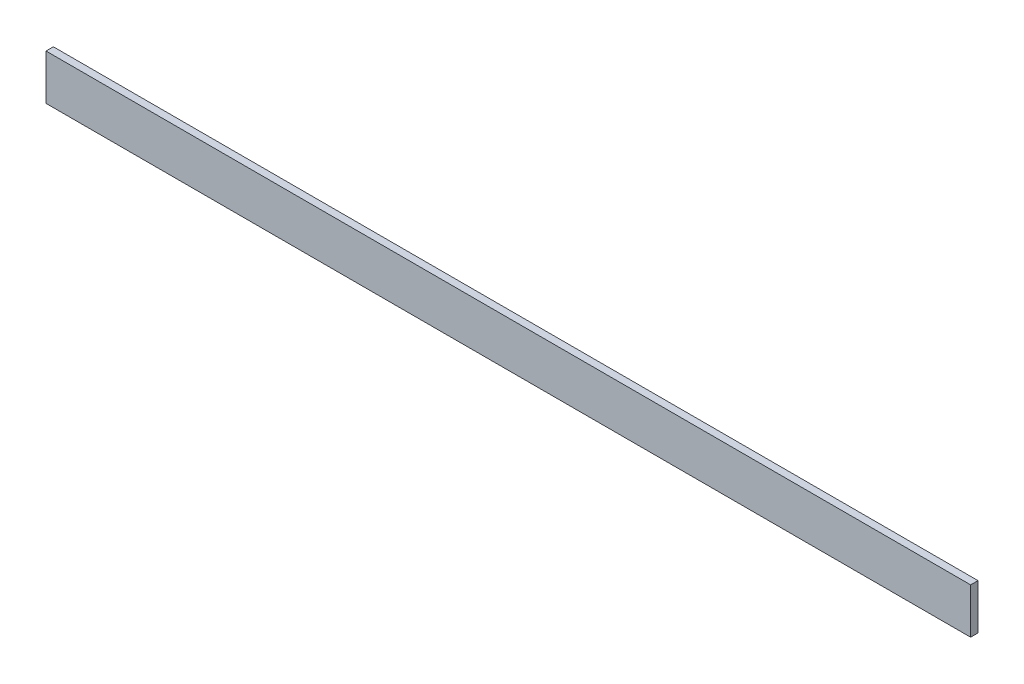
ISO-10303-21;
HEADER;
FILE_DESCRIPTION(('STEP AP214'),'2;1');
FILE_NAME('part.step','',(''),(''),'','','');
FILE_SCHEMA(('AUTOMOTIVE_DESIGN { 1 0 10303 214 1 1 1 1 }'));
ENDSEC;
DATA;
#1=APPLICATION_CONTEXT('core data for automotive mechanical design processes');
#2=APPLICATION_PROTOCOL_DEFINITION('international standard','automotive_design',2000,#1);
#3=PRODUCT_CONTEXT('',#1,'mechanical');
#4=PRODUCT('Part','Part','',(#3));
#5=PRODUCT_RELATED_PRODUCT_CATEGORY('part','',(#4));
#6=PRODUCT_DEFINITION_FORMATION('','',#4);
#7=PRODUCT_DEFINITION_CONTEXT('part definition',#1,'design');
#8=PRODUCT_DEFINITION('design','',#6,#7);
#9=PRODUCT_DEFINITION_SHAPE('','',#8);
#10=(LENGTH_UNIT() NAMED_UNIT(*) SI_UNIT(.MILLI.,.METRE.));
#11=(NAMED_UNIT(*) PLANE_ANGLE_UNIT() SI_UNIT($,.RADIAN.));
#12=(NAMED_UNIT(*) SI_UNIT($,.STERADIAN.) SOLID_ANGLE_UNIT());
#13=UNCERTAINTY_MEASURE_WITH_UNIT(LENGTH_MEASURE(1.E-05),#10,'distance_accuracy_value','');
#14=(GEOMETRIC_REPRESENTATION_CONTEXT(3) GLOBAL_UNCERTAINTY_ASSIGNED_CONTEXT((#13)) GLOBAL_UNIT_ASSIGNED_CONTEXT((#10,
#11,#12)) REPRESENTATION_CONTEXT('',''));
#15=CARTESIAN_POINT('',(0.,0.,0.));
#16=DIRECTION('',(0.,0.,1.));
#17=DIRECTION('',(1.,0.,0.));
#18=AXIS2_PLACEMENT_3D('',#15,#16,#17);
#19=CARTESIAN_POINT('',(0.,0.,38.1));
#20=DIRECTION('',(1.,0.,0.));
#21=DIRECTION('',(0.,0.,-1.));
#22=AXIS2_PLACEMENT_3D('',#19,#20,#21);
#23=PLANE('',#22);
#24=DIRECTION('',(0.,-1.,0.));
#25=VECTOR('',#24,1.);
#26=CARTESIAN_POINT('',(0.,0.,0.));
#27=LINE('',#26,#25);
#28=CARTESIAN_POINT('',(0.,234.95,0.));
#29=VERTEX_POINT('',#28);
#30=CARTESIAN_POINT('',(0.,0.,0.));
#31=VERTEX_POINT('',#30);
#32=EDGE_CURVE('E96',#29,#31,#27,.T.);
#33=ORIENTED_EDGE('',*,*,#32,.T.);
#34=DIRECTION('',(0.,0.,-1.));
#35=VECTOR('',#34,1.);
#36=CARTESIAN_POINT('',(0.,0.,38.1));
#37=LINE('',#36,#35);
#38=CARTESIAN_POINT('',(0.,0.,38.1));
#39=VERTEX_POINT('',#38);
#40=EDGE_CURVE('E11',#39,#31,#37,.T.);
#41=ORIENTED_EDGE('',*,*,#40,.F.);
#42=DIRECTION('',(0.,-1.,0.));
#43=VECTOR('',#42,1.);
#44=CARTESIAN_POINT('',(0.,0.,38.1));
#45=LINE('',#44,#43);
#46=CARTESIAN_POINT('',(0.,234.95,38.1));
#47=VERTEX_POINT('',#46);
#48=EDGE_CURVE('E84',#47,#39,#45,.T.);
#49=ORIENTED_EDGE('',*,*,#48,.F.);
#50=DIRECTION('',(0.,0.,-1.));
#51=VECTOR('',#50,1.);
#52=CARTESIAN_POINT('',(0.,234.95,38.1));
#53=LINE('',#52,#51);
#54=EDGE_CURVE('E92',#47,#29,#53,.T.);
#55=ORIENTED_EDGE('',*,*,#54,.T.);
#56=EDGE_LOOP('',(#33,#41,#49,#55));
#57=FACE_BOUND('',#56,.T.);
#58=ADVANCED_FACE('F33',(#57),#23,.F.);
#59=CARTESIAN_POINT('',(0.,0.,38.1));
#60=DIRECTION('',(0.,1.,0.));
#61=DIRECTION('',(0.,0.,1.));
#62=AXIS2_PLACEMENT_3D('',#59,#60,#61);
#63=PLANE('',#62);
#64=DIRECTION('',(1.,0.,0.));
#65=VECTOR('',#64,1.);
#66=CARTESIAN_POINT('',(0.,0.,0.));
#67=LINE('',#66,#65);
#68=CARTESIAN_POINT('',(4787.9,0.,0.));
#69=VERTEX_POINT('',#68);
#70=EDGE_CURVE('E88',#31,#69,#67,.T.);
#71=ORIENTED_EDGE('',*,*,#70,.T.);
#72=DIRECTION('',(0.,0.,-1.));
#73=VECTOR('',#72,1.);
#74=CARTESIAN_POINT('',(4787.9,0.,38.1));
#75=LINE('',#74,#73);
#76=CARTESIAN_POINT('',(4787.9,0.,38.1));
#77=VERTEX_POINT('',#76);
#78=EDGE_CURVE('E41',#77,#69,#75,.T.);
#79=ORIENTED_EDGE('',*,*,#78,.F.);
#80=DIRECTION('',(1.,0.,0.));
#81=VECTOR('',#80,1.);
#82=CARTESIAN_POINT('',(0.,0.,38.1));
#83=LINE('',#82,#81);
#84=EDGE_CURVE('E79',#39,#77,#83,.T.);
#85=ORIENTED_EDGE('',*,*,#84,.F.);
#86=ORIENTED_EDGE('',*,*,#40,.T.);
#87=EDGE_LOOP('',(#71,#79,#85,#86));
#88=FACE_BOUND('',#87,.T.);
#89=ADVANCED_FACE('F87',(#88),#63,.F.);
#90=CARTESIAN_POINT('',(4787.9,0.,38.1));
#91=DIRECTION('',(-1.,0.,0.));
#92=DIRECTION('',(0.,0.,1.));
#93=AXIS2_PLACEMENT_3D('',#90,#91,#92);
#94=PLANE('',#93);
#95=DIRECTION('',(0.,1.,0.));
#96=VECTOR('',#95,1.);
#97=CARTESIAN_POINT('',(4787.9,0.,0.));
#98=LINE('',#97,#96);
#99=CARTESIAN_POINT('',(4787.9,234.95,0.));
#100=VERTEX_POINT('',#99);
#101=EDGE_CURVE('E66',#69,#100,#98,.T.);
#102=ORIENTED_EDGE('',*,*,#101,.T.);
#103=DIRECTION('',(0.,0.,-1.));
#104=VECTOR('',#103,1.);
#105=CARTESIAN_POINT('',(4787.9,234.95,38.1));
#106=LINE('',#105,#104);
#107=CARTESIAN_POINT('',(4787.9,234.95,38.1));
#108=VERTEX_POINT('',#107);
#109=EDGE_CURVE('E89',#108,#100,#106,.T.);
#110=ORIENTED_EDGE('',*,*,#109,.F.);
#111=DIRECTION('',(0.,1.,0.));
#112=VECTOR('',#111,1.);
#113=CARTESIAN_POINT('',(4787.9,0.,38.1));
#114=LINE('',#113,#112);
#115=EDGE_CURVE('E82',#77,#108,#114,.T.);
#116=ORIENTED_EDGE('',*,*,#115,.F.);
#117=ORIENTED_EDGE('',*,*,#78,.T.);
#118=EDGE_LOOP('',(#102,#110,#116,#117));
#119=FACE_BOUND('',#118,.T.);
#120=ADVANCED_FACE('F90',(#119),#94,.F.);
#121=CARTESIAN_POINT('',(0.,234.95,38.1));
#122=DIRECTION('',(0.,-1.,0.));
#123=DIRECTION('',(0.,0.,-1.));
#124=AXIS2_PLACEMENT_3D('',#121,#122,#123);
#125=PLANE('',#124);
#126=DIRECTION('',(-1.,0.,0.));
#127=VECTOR('',#126,1.);
#128=CARTESIAN_POINT('',(0.,234.95,0.));
#129=LINE('',#128,#127);
#130=EDGE_CURVE('E72',#100,#29,#129,.T.);
#131=ORIENTED_EDGE('',*,*,#130,.T.);
#132=ORIENTED_EDGE('',*,*,#54,.F.);
#133=DIRECTION('',(-1.,0.,0.));
#134=VECTOR('',#133,1.);
#135=CARTESIAN_POINT('',(0.,234.95,38.1));
#136=LINE('',#135,#134);
#137=EDGE_CURVE('E49',#108,#47,#136,.T.);
#138=ORIENTED_EDGE('',*,*,#137,.F.);
#139=ORIENTED_EDGE('',*,*,#109,.T.);
#140=EDGE_LOOP('',(#131,#132,#138,#139));
#141=FACE_BOUND('',#140,.T.);
#142=ADVANCED_FACE('F103',(#141),#125,.F.);
#143=CARTESIAN_POINT('',(0.,0.,38.1));
#144=DIRECTION('',(0.,0.,-1.));
#145=DIRECTION('',(-1.,0.,0.));
#146=AXIS2_PLACEMENT_3D('',#143,#144,#145);
#147=PLANE('',#146);
#148=ORIENTED_EDGE('',*,*,#48,.T.);
#149=ORIENTED_EDGE('',*,*,#84,.T.);
#150=ORIENTED_EDGE('',*,*,#115,.T.);
#151=ORIENTED_EDGE('',*,*,#137,.T.);
#152=EDGE_LOOP('',(#148,#149,#150,#151));
#153=FACE_BOUND('',#152,.T.);
#154=ADVANCED_FACE('F80',(#153),#147,.F.);
#155=CARTESIAN_POINT('',(0.,0.,0.));
#156=DIRECTION('',(0.,0.,-1.));
#157=DIRECTION('',(-1.,0.,0.));
#158=AXIS2_PLACEMENT_3D('',#155,#156,#157);
#159=PLANE('',#158);
#160=ORIENTED_EDGE('',*,*,#32,.F.);
#161=ORIENTED_EDGE('',*,*,#130,.F.);
#162=ORIENTED_EDGE('',*,*,#101,.F.);
#163=ORIENTED_EDGE('',*,*,#70,.F.);
#164=EDGE_LOOP('',(#160,#161,#162,#163));
#165=FACE_BOUND('',#164,.T.);
#166=ADVANCED_FACE('F106',(#165),#159,.T.);
#167=CLOSED_SHELL('',(#58,#89,#120,#142,#154,#166));
#168=MANIFOLD_SOLID_BREP('B2',#167);
#169=ADVANCED_BREP_SHAPE_REPRESENTATION('',(#18,#168),#14);
#170=SHAPE_DEFINITION_REPRESENTATION(#9,#169);
ENDSEC;
END-ISO-10303-21;
